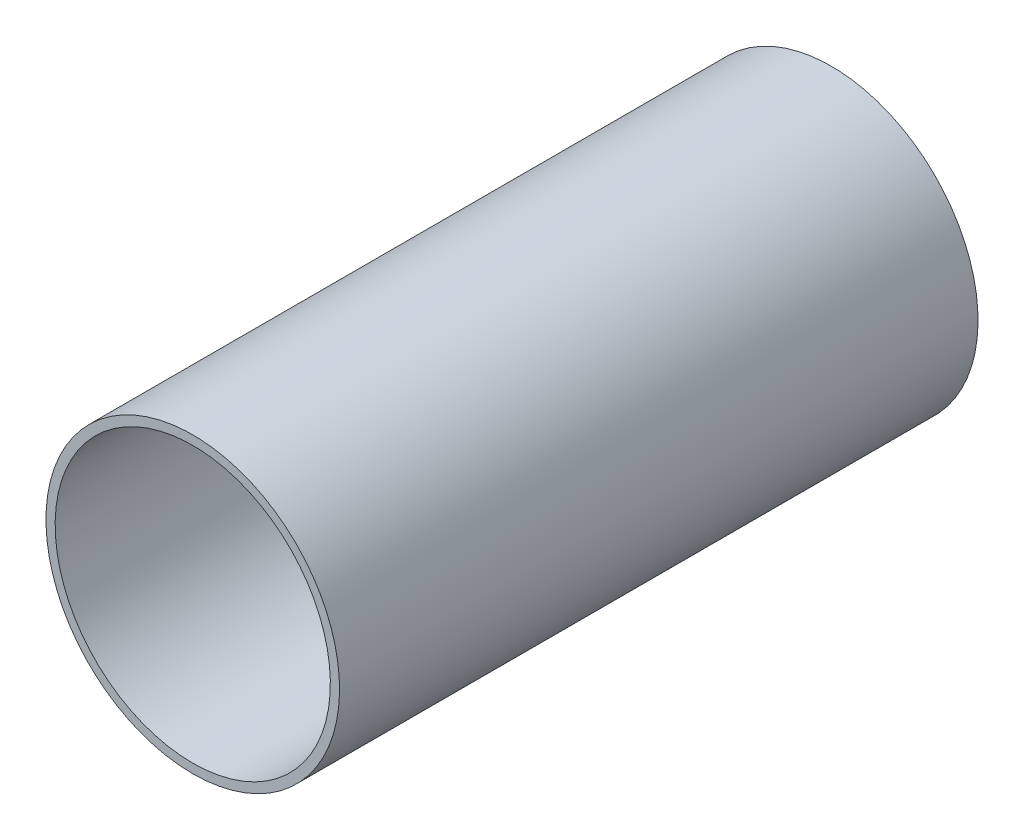
ISO-10303-21;
HEADER;
FILE_DESCRIPTION(('STEP AP214'),'2;1');
FILE_NAME('part.step','',(''),(''),'','','');
FILE_SCHEMA(('AUTOMOTIVE_DESIGN { 1 0 10303 214 1 1 1 1 }'));
ENDSEC;
DATA;
#1=APPLICATION_CONTEXT('core data for automotive mechanical design processes');
#2=APPLICATION_PROTOCOL_DEFINITION('international standard','automotive_design',2000,#1);
#3=PRODUCT_CONTEXT('',#1,'mechanical');
#4=PRODUCT('Part','Part','',(#3));
#5=PRODUCT_RELATED_PRODUCT_CATEGORY('part','',(#4));
#6=PRODUCT_DEFINITION_FORMATION('','',#4);
#7=PRODUCT_DEFINITION_CONTEXT('part definition',#1,'design');
#8=PRODUCT_DEFINITION('design','',#6,#7);
#9=PRODUCT_DEFINITION_SHAPE('','',#8);
#10=(LENGTH_UNIT() NAMED_UNIT(*) SI_UNIT(.MILLI.,.METRE.));
#11=(NAMED_UNIT(*) PLANE_ANGLE_UNIT() SI_UNIT($,.RADIAN.));
#12=(NAMED_UNIT(*) SI_UNIT($,.STERADIAN.) SOLID_ANGLE_UNIT());
#13=UNCERTAINTY_MEASURE_WITH_UNIT(LENGTH_MEASURE(1.E-05),#10,'distance_accuracy_value','');
#14=(GEOMETRIC_REPRESENTATION_CONTEXT(3) GLOBAL_UNCERTAINTY_ASSIGNED_CONTEXT((#13)) GLOBAL_UNIT_ASSIGNED_CONTEXT((#10,
#11,#12)) REPRESENTATION_CONTEXT('',''));
#15=CARTESIAN_POINT('',(0.,0.,0.));
#16=DIRECTION('',(0.,0.,1.));
#17=DIRECTION('',(1.,0.,0.));
#18=AXIS2_PLACEMENT_3D('',#15,#16,#17);
#19=CARTESIAN_POINT('',(117.856,-120.396,-0.045));
#20=DIRECTION('',(0.,0.,-1.));
#21=DIRECTION('',(0.,-1.,0.));
#22=AXIS2_PLACEMENT_3D('',#19,#20,#21);
#23=CYLINDRICAL_SURFACE('',#22,0.375);
#24=CARTESIAN_POINT('',(117.856,-120.396,-0.035));
#25=DIRECTION('',(0.,0.,-1.));
#26=DIRECTION('',(0.,-1.,0.));
#27=AXIS2_PLACEMENT_3D('',#24,#25,#26);
#28=CIRCLE('',#27,0.375);
#29=CARTESIAN_POINT('',(117.856,-120.771,-0.035));
#30=VERTEX_POINT('',#29);
#31=EDGE_CURVE('E64',#30,#30,#28,.T.);
#32=ORIENTED_EDGE('',*,*,#31,.T.);
#33=DIRECTION('',(0.,0.,1.));
#34=VECTOR('',#33,1.);
#35=CARTESIAN_POINT('',(117.856,-120.771,-0.045));
#36=LINE('',#35,#34);
#37=CARTESIAN_POINT('',(117.856,-120.771,1.705));
#38=VERTEX_POINT('',#37);
#39=EDGE_CURVE('E11',#30,#38,#36,.T.);
#40=ORIENTED_EDGE('',*,*,#39,.T.);
#41=CARTESIAN_POINT('',(117.856,-120.396,1.705));
#42=DIRECTION('',(0.,0.,-1.));
#43=DIRECTION('',(0.,-1.,0.));
#44=AXIS2_PLACEMENT_3D('',#41,#42,#43);
#45=CIRCLE('',#44,0.375);
#46=EDGE_CURVE('E25',#38,#38,#45,.T.);
#47=ORIENTED_EDGE('',*,*,#46,.F.);
#48=ORIENTED_EDGE('',*,*,#39,.F.);
#49=EDGE_LOOP('',(#32,#40,#47,#48));
#50=FACE_BOUND('',#49,.T.);
#51=ADVANCED_FACE('F17',(#50),#23,.F.);
#52=CARTESIAN_POINT('',(117.856,-120.796,1.705));
#53=DIRECTION('',(0.,0.,1.));
#54=DIRECTION('',(1.,0.,0.));
#55=AXIS2_PLACEMENT_3D('',#52,#53,#54);
#56=PLANE('',#55);
#57=ORIENTED_EDGE('',*,*,#46,.T.);
#58=EDGE_LOOP('',(#57));
#59=FACE_BOUND('',#58,.T.);
#60=CARTESIAN_POINT('',(117.856,-120.396,1.705));
#61=DIRECTION('',(0.,0.,1.));
#62=DIRECTION('',(0.,-1.,0.));
#63=AXIS2_PLACEMENT_3D('',#60,#61,#62);
#64=CIRCLE('',#63,0.4);
#65=CARTESIAN_POINT('',(117.856,-120.796,1.705));
#66=VERTEX_POINT('',#65);
#67=EDGE_CURVE('E56',#66,#66,#64,.T.);
#68=ORIENTED_EDGE('',*,*,#67,.T.);
#69=EDGE_LOOP('',(#68));
#70=FACE_BOUND('',#69,.T.);
#71=ADVANCED_FACE('F76',(#59,#70),#56,.T.);
#72=CARTESIAN_POINT('',(117.856,-120.796,-0.035));
#73=DIRECTION('',(0.,0.,1.));
#74=DIRECTION('',(1.,0.,0.));
#75=AXIS2_PLACEMENT_3D('',#72,#73,#74);
#76=PLANE('',#75);
#77=ORIENTED_EDGE('',*,*,#31,.F.);
#78=EDGE_LOOP('',(#77));
#79=FACE_BOUND('',#78,.T.);
#80=CARTESIAN_POINT('',(117.856,-120.396,-0.035));
#81=DIRECTION('',(0.,0.,1.));
#82=DIRECTION('',(0.,-1.,0.));
#83=AXIS2_PLACEMENT_3D('',#80,#81,#82);
#84=CIRCLE('',#83,0.4);
#85=CARTESIAN_POINT('',(117.856,-120.796,-0.035));
#86=VERTEX_POINT('',#85);
#87=EDGE_CURVE('E55',#86,#86,#84,.T.);
#88=ORIENTED_EDGE('',*,*,#87,.F.);
#89=EDGE_LOOP('',(#88));
#90=FACE_BOUND('',#89,.T.);
#91=ADVANCED_FACE('F84',(#79,#90),#76,.F.);
#92=CARTESIAN_POINT('',(117.856,-120.396,-0.035));
#93=DIRECTION('',(0.,0.,-1.));
#94=DIRECTION('',(0.,-1.,0.));
#95=AXIS2_PLACEMENT_3D('',#92,#93,#94);
#96=CYLINDRICAL_SURFACE('',#95,0.4);
#97=ORIENTED_EDGE('',*,*,#87,.T.);
#98=DIRECTION('',(0.,0.,1.));
#99=VECTOR('',#98,1.);
#100=CARTESIAN_POINT('',(117.856,-120.796,-0.035));
#101=LINE('',#100,#99);
#102=EDGE_CURVE('E52',#86,#66,#101,.T.);
#103=ORIENTED_EDGE('',*,*,#102,.T.);
#104=ORIENTED_EDGE('',*,*,#67,.F.);
#105=ORIENTED_EDGE('',*,*,#102,.F.);
#106=EDGE_LOOP('',(#97,#103,#104,#105));
#107=FACE_BOUND('',#106,.T.);
#108=ADVANCED_FACE('F53',(#107),#96,.T.);
#109=CLOSED_SHELL('',(#51,#71,#91,#108));
#110=MANIFOLD_SOLID_BREP('B1',#109);
#111=ADVANCED_BREP_SHAPE_REPRESENTATION('',(#18,#110),#14);
#112=SHAPE_DEFINITION_REPRESENTATION(#9,#111);
ENDSEC;
END-ISO-10303-21;
